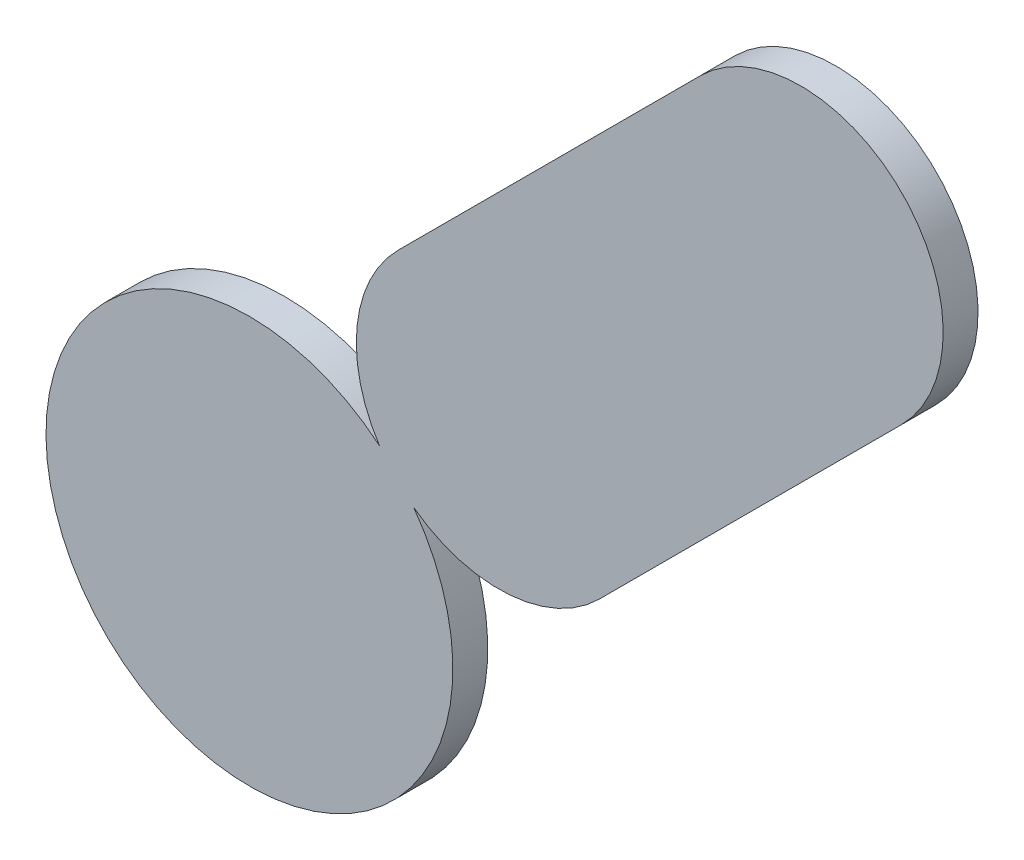
ISO-10303-21;
HEADER;
FILE_DESCRIPTION(('STEP AP214'),'2;1');
FILE_NAME('part.step','',(''),(''),'','','');
FILE_SCHEMA(('AUTOMOTIVE_DESIGN { 1 0 10303 214 1 1 1 1 }'));
ENDSEC;
DATA;
#1=APPLICATION_CONTEXT('core data for automotive mechanical design processes');
#2=APPLICATION_PROTOCOL_DEFINITION('international standard','automotive_design',2000,#1);
#3=PRODUCT_CONTEXT('',#1,'mechanical');
#4=PRODUCT('Part','Part','',(#3));
#5=PRODUCT_RELATED_PRODUCT_CATEGORY('part','',(#4));
#6=PRODUCT_DEFINITION_FORMATION('','',#4);
#7=PRODUCT_DEFINITION_CONTEXT('part definition',#1,'design');
#8=PRODUCT_DEFINITION('design','',#6,#7);
#9=PRODUCT_DEFINITION_SHAPE('','',#8);
#10=(LENGTH_UNIT() NAMED_UNIT(*) SI_UNIT(.MILLI.,.METRE.));
#11=(NAMED_UNIT(*) PLANE_ANGLE_UNIT() SI_UNIT($,.RADIAN.));
#12=(NAMED_UNIT(*) SI_UNIT($,.STERADIAN.) SOLID_ANGLE_UNIT());
#13=UNCERTAINTY_MEASURE_WITH_UNIT(LENGTH_MEASURE(1.E-05),#10,'distance_accuracy_value','');
#14=(GEOMETRIC_REPRESENTATION_CONTEXT(3) GLOBAL_UNCERTAINTY_ASSIGNED_CONTEXT((#13)) GLOBAL_UNIT_ASSIGNED_CONTEXT((#10,
#11,#12)) REPRESENTATION_CONTEXT('',''));
#15=CARTESIAN_POINT('',(0.,0.,0.));
#16=DIRECTION('',(0.,0.,1.));
#17=DIRECTION('',(1.,0.,0.));
#18=AXIS2_PLACEMENT_3D('',#15,#16,#17);
#19=CARTESIAN_POINT('',(3.561773874095,2.997860960394,0.79916));
#20=DIRECTION('',(0.,0.,1.));
#21=DIRECTION('',(0.,-1.,0.));
#22=AXIS2_PLACEMENT_3D('',#19,#20,#21);
#23=PLANE('',#22);
#24=CARTESIAN_POINT('',(3.577542999727,3.003989565459,0.79916));
#25=DIRECTION('',(0.,0.,1.));
#26=DIRECTION('',(0.,-1.,0.));
#27=AXIS2_PLACEMENT_3D('',#24,#25,#26);
#28=CIRCLE('',#27,0.14);
#29=CARTESIAN_POINT('',(3.67653798298567,2.90499464998552,0.79916));
#30=VERTEX_POINT('',#29);
#31=CARTESIAN_POINT('',(3.49403143999944,2.89162489400066,0.79916));
#32=VERTEX_POINT('',#31);
#33=EDGE_CURVE('E20',#30,#32,#28,.F.);
#34=ORIENTED_EDGE('',*,*,#33,.F.);
#35=DIRECTION('',(-0.707106660628037,-0.707106901745037,0.));
#36=VECTOR('',#35,1.);
#37=CARTESIAN_POINT('',(3.973522615866,3.201979384135,0.79916));
#38=LINE('',#37,#36);
#39=CARTESIAN_POINT('',(3.97352279105482,3.20197955932388,0.79916));
#40=VERTEX_POINT('',#39);
#41=EDGE_CURVE('E83',#30,#40,#38,.F.);
#42=ORIENTED_EDGE('',*,*,#41,.T.);
#43=CARTESIAN_POINT('',(3.874527667,3.300974434268,0.79916));
#44=DIRECTION('',(0.,0.,1.));
#45=DIRECTION('',(0.,-1.,0.));
#46=AXIS2_PLACEMENT_3D('',#43,#44,#45);
#47=CIRCLE('',#46,0.14);
#48=CARTESIAN_POINT('',(3.7755327310553,3.39996939705526,0.79916));
#49=VERTEX_POINT('',#48);
#50=EDGE_CURVE('E97',#49,#40,#47,.F.);
#51=ORIENTED_EDGE('',*,*,#50,.F.);
#52=DIRECTION('',(0.707107334590331,0.707106227782331,0.));
#53=VECTOR('',#52,1.);
#54=CARTESIAN_POINT('',(3.478547768071,3.10298489893,0.79916));
#55=LINE('',#54,#53);
#56=CARTESIAN_POINT('',(3.47854778159029,3.10298491244927,0.79916));
#57=VERTEX_POINT('',#56);
#58=EDGE_CURVE('E95',#49,#57,#55,.F.);
#59=ORIENTED_EDGE('',*,*,#58,.T.);
#60=CARTESIAN_POINT('',(3.577542666999,3.003989899126,0.79916));
#61=DIRECTION('',(0.,0.,1.));
#62=DIRECTION('',(0.,-1.,0.));
#63=AXIS2_PLACEMENT_3D('',#60,#61,#62);
#64=CIRCLE('',#63,0.14);
#65=CARTESIAN_POINT('',(3.46021566900051,2.92760681499959,0.79916));
#66=VERTEX_POINT('',#65);
#67=EDGE_CURVE('E71',#66,#57,#64,.F.);
#68=ORIENTED_EDGE('',*,*,#67,.F.);
#69=CARTESIAN_POINT('',(3.33248,2.773679993836,0.79916));
#70=DIRECTION('',(0.,0.,1.));
#71=DIRECTION('',(0.,-1.,0.));
#72=AXIS2_PLACEMENT_3D('',#69,#70,#71);
#73=CIRCLE('',#72,0.200024667);
#74=EDGE_CURVE('E66',#32,#66,#73,.F.);
#75=ORIENTED_EDGE('',*,*,#74,.F.);
#76=EDGE_LOOP('',(#34,#42,#51,#59,#68,#75));
#77=FACE_BOUND('',#76,.T.);
#78=ADVANCED_FACE('F17',(#77),#23,.T.);
#79=CARTESIAN_POINT('',(3.973522615866,3.201979384135,0.76487));
#80=DIRECTION('',(-0.707106901745037,0.707106660628037,0.));
#81=DIRECTION('',(-0.707106660628037,-0.707106901745037,0.));
#82=AXIS2_PLACEMENT_3D('',#79,#80,#81);
#83=PLANE('',#82);
#84=DIRECTION('',(0.,0.,1.));
#85=VECTOR('',#84,1.);
#86=CARTESIAN_POINT('',(3.6765380000001,2.9049946669999,0.76487));
#87=LINE('',#86,#85);
#88=CARTESIAN_POINT('',(3.67653798298562,2.90499464998556,0.76487));
#89=VERTEX_POINT('',#88);
#90=EDGE_CURVE('E82',#89,#30,#87,.T.);
#91=ORIENTED_EDGE('',*,*,#90,.F.);
#92=DIRECTION('',(-0.70710666062813,-0.707106901744944,0.));
#93=VECTOR('',#92,1.);
#94=CARTESIAN_POINT('',(3.973522615866,3.201979384135,0.76487));
#95=LINE('',#94,#93);
#96=CARTESIAN_POINT('',(3.97352279105481,3.20197955932387,0.76487));
#97=VERTEX_POINT('',#96);
#98=EDGE_CURVE('E105',#97,#89,#95,.T.);
#99=ORIENTED_EDGE('',*,*,#98,.F.);
#100=DIRECTION('',(0.,0.,1.));
#101=VECTOR('',#100,1.);
#102=CARTESIAN_POINT('',(3.973522615866,3.201979384135,0.76487));
#103=LINE('',#102,#101);
#104=EDGE_CURVE('E93',#40,#97,#103,.F.);
#105=ORIENTED_EDGE('',*,*,#104,.F.);
#106=ORIENTED_EDGE('',*,*,#41,.F.);
#107=EDGE_LOOP('',(#91,#99,#105,#106));
#108=FACE_BOUND('',#107,.T.);
#109=ADVANCED_FACE('F122',(#108),#83,.F.);
#110=CARTESIAN_POINT('',(3.577542999727,3.003989565459,0.76487));
#111=DIRECTION('',(0.,0.,1.));
#112=DIRECTION('',(0.,-1.,0.));
#113=AXIS2_PLACEMENT_3D('',#110,#111,#112);
#114=CYLINDRICAL_SURFACE('',#113,0.14);
#115=CARTESIAN_POINT('',(3.577542999727,3.003989565459,0.76487));
#116=DIRECTION('',(0.,0.,1.));
#117=DIRECTION('',(0.,-1.,0.));
#118=AXIS2_PLACEMENT_3D('',#115,#116,#117);
#119=CIRCLE('',#118,0.14);
#120=CARTESIAN_POINT('',(3.49403143999944,2.89162489400066,0.76487));
#121=VERTEX_POINT('',#120);
#122=EDGE_CURVE('E103',#89,#121,#119,.F.);
#123=ORIENTED_EDGE('',*,*,#122,.F.);
#124=ORIENTED_EDGE('',*,*,#90,.T.);
#125=ORIENTED_EDGE('',*,*,#33,.T.);
#126=DIRECTION('',(0.,0.,1.));
#127=VECTOR('',#126,1.);
#128=CARTESIAN_POINT('',(3.49403143999995,2.89162489399996,0.76487));
#129=LINE('',#128,#127);
#130=EDGE_CURVE('E76',#121,#32,#129,.T.);
#131=ORIENTED_EDGE('',*,*,#130,.F.);
#132=EDGE_LOOP('',(#123,#124,#125,#131));
#133=FACE_BOUND('',#132,.T.);
#134=ADVANCED_FACE('F80',(#133),#114,.T.);
#135=CARTESIAN_POINT('',(3.33248,2.773679993836,0.76487));
#136=DIRECTION('',(0.,0.,1.));
#137=DIRECTION('',(0.,-1.,0.));
#138=AXIS2_PLACEMENT_3D('',#135,#136,#137);
#139=CYLINDRICAL_SURFACE('',#138,0.200024667);
#140=DIRECTION('',(0.,0.,1.));
#141=VECTOR('',#140,1.);
#142=CARTESIAN_POINT('',(3.46021566900017,2.92760681500011,0.76487));
#143=LINE('',#142,#141);
#144=CARTESIAN_POINT('',(3.46021566900051,2.92760681499959,0.76487));
#145=VERTEX_POINT('',#144);
#146=EDGE_CURVE('E90',#145,#66,#143,.T.);
#147=ORIENTED_EDGE('',*,*,#146,.F.);
#148=CARTESIAN_POINT('',(3.33248,2.773679993125,0.76487));
#149=DIRECTION('',(0.,0.,1.));
#150=DIRECTION('',(0.,-1.,0.));
#151=AXIS2_PLACEMENT_3D('',#148,#149,#150);
#152=CIRCLE('',#151,0.200024667);
#153=EDGE_CURVE('E85',#121,#145,#152,.F.);
#154=ORIENTED_EDGE('',*,*,#153,.F.);
#155=ORIENTED_EDGE('',*,*,#130,.T.);
#156=ORIENTED_EDGE('',*,*,#74,.T.);
#157=EDGE_LOOP('',(#147,#154,#155,#156));
#158=FACE_BOUND('',#157,.T.);
#159=ADVANCED_FACE('F84',(#158),#139,.T.);
#160=CARTESIAN_POINT('',(3.577542666999,3.003989899126,0.76487));
#161=DIRECTION('',(0.,0.,1.));
#162=DIRECTION('',(0.,-1.,0.));
#163=AXIS2_PLACEMENT_3D('',#160,#161,#162);
#164=CYLINDRICAL_SURFACE('',#163,0.14);
#165=CARTESIAN_POINT('',(3.577542666999,3.003989899126,0.76487));
#166=DIRECTION('',(0.,0.,1.));
#167=DIRECTION('',(0.,-1.,0.));
#168=AXIS2_PLACEMENT_3D('',#165,#166,#167);
#169=CIRCLE('',#168,0.14);
#170=CARTESIAN_POINT('',(3.47854778159028,3.10298491244926,0.76487));
#171=VERTEX_POINT('',#170);
#172=EDGE_CURVE('E26',#145,#171,#169,.F.);
#173=ORIENTED_EDGE('',*,*,#172,.F.);
#174=ORIENTED_EDGE('',*,*,#146,.T.);
#175=ORIENTED_EDGE('',*,*,#67,.T.);
#176=DIRECTION('',(0.,0.,1.));
#177=VECTOR('',#176,1.);
#178=CARTESIAN_POINT('',(3.478547768071,3.10298489893,0.76487));
#179=LINE('',#178,#177);
#180=EDGE_CURVE('E98',#57,#171,#179,.F.);
#181=ORIENTED_EDGE('',*,*,#180,.T.);
#182=EDGE_LOOP('',(#173,#174,#175,#181));
#183=FACE_BOUND('',#182,.T.);
#184=ADVANCED_FACE('F127',(#183),#164,.T.);
#185=CARTESIAN_POINT('',(3.478547768071,3.10298489893,0.76487));
#186=DIRECTION('',(0.707106227782331,-0.707107334590331,0.));
#187=DIRECTION('',(0.707107334590331,0.707106227782331,0.));
#188=AXIS2_PLACEMENT_3D('',#185,#186,#187);
#189=PLANE('',#188);
#190=DIRECTION('',(0.,0.,1.));
#191=VECTOR('',#190,1.);
#192=CARTESIAN_POINT('',(3.7755326669999,3.3999693330001,0.76487));
#193=LINE('',#192,#191);
#194=CARTESIAN_POINT('',(3.77553273105527,3.39996939705527,0.76487));
#195=VERTEX_POINT('',#194);
#196=EDGE_CURVE('E107',#195,#49,#193,.T.);
#197=ORIENTED_EDGE('',*,*,#196,.F.);
#198=DIRECTION('',(0.707107334590241,0.707106227782421,0.));
#199=VECTOR('',#198,1.);
#200=CARTESIAN_POINT('',(3.478547768071,3.10298489893,0.76487));
#201=LINE('',#200,#199);
#202=EDGE_CURVE('E11',#171,#195,#201,.T.);
#203=ORIENTED_EDGE('',*,*,#202,.F.);
#204=ORIENTED_EDGE('',*,*,#180,.F.);
#205=ORIENTED_EDGE('',*,*,#58,.F.);
#206=EDGE_LOOP('',(#197,#203,#204,#205));
#207=FACE_BOUND('',#206,.T.);
#208=ADVANCED_FACE('F126',(#207),#189,.F.);
#209=CARTESIAN_POINT('',(3.874527667,3.300974434268,0.76487));
#210=DIRECTION('',(0.,0.,1.));
#211=DIRECTION('',(0.,-1.,0.));
#212=AXIS2_PLACEMENT_3D('',#209,#210,#211);
#213=CYLINDRICAL_SURFACE('',#212,0.14);
#214=CARTESIAN_POINT('',(3.874528,3.300974667,0.76487));
#215=DIRECTION('',(0.,0.,1.));
#216=DIRECTION('',(0.,-1.,0.));
#217=AXIS2_PLACEMENT_3D('',#214,#215,#216);
#218=CIRCLE('',#217,0.14);
#219=EDGE_CURVE('E35',#195,#97,#218,.F.);
#220=ORIENTED_EDGE('',*,*,#219,.F.);
#221=ORIENTED_EDGE('',*,*,#196,.T.);
#222=ORIENTED_EDGE('',*,*,#50,.T.);
#223=ORIENTED_EDGE('',*,*,#104,.T.);
#224=EDGE_LOOP('',(#220,#221,#222,#223));
#225=FACE_BOUND('',#224,.T.);
#226=ADVANCED_FACE('F124',(#225),#213,.T.);
#227=CARTESIAN_POINT('',(3.561773874095,2.997860960394,0.76487));
#228=DIRECTION('',(0.,0.,-1.));
#229=DIRECTION('',(0.,1.,0.));
#230=AXIS2_PLACEMENT_3D('',#227,#228,#229);
#231=PLANE('',#230);
#232=ORIENTED_EDGE('',*,*,#202,.T.);
#233=ORIENTED_EDGE('',*,*,#219,.T.);
#234=ORIENTED_EDGE('',*,*,#98,.T.);
#235=ORIENTED_EDGE('',*,*,#122,.T.);
#236=ORIENTED_EDGE('',*,*,#153,.T.);
#237=ORIENTED_EDGE('',*,*,#172,.T.);
#238=EDGE_LOOP('',(#232,#233,#234,#235,#236,#237));
#239=FACE_BOUND('',#238,.T.);
#240=ADVANCED_FACE('F119',(#239),#231,.T.);
#241=CLOSED_SHELL('',(#78,#109,#134,#159,#184,#208,#226,#240));
#242=MANIFOLD_SOLID_BREP('B1',#241);
#243=ADVANCED_BREP_SHAPE_REPRESENTATION('',(#18,#242),#14);
#244=SHAPE_DEFINITION_REPRESENTATION(#9,#243);
ENDSEC;
END-ISO-10303-21;
